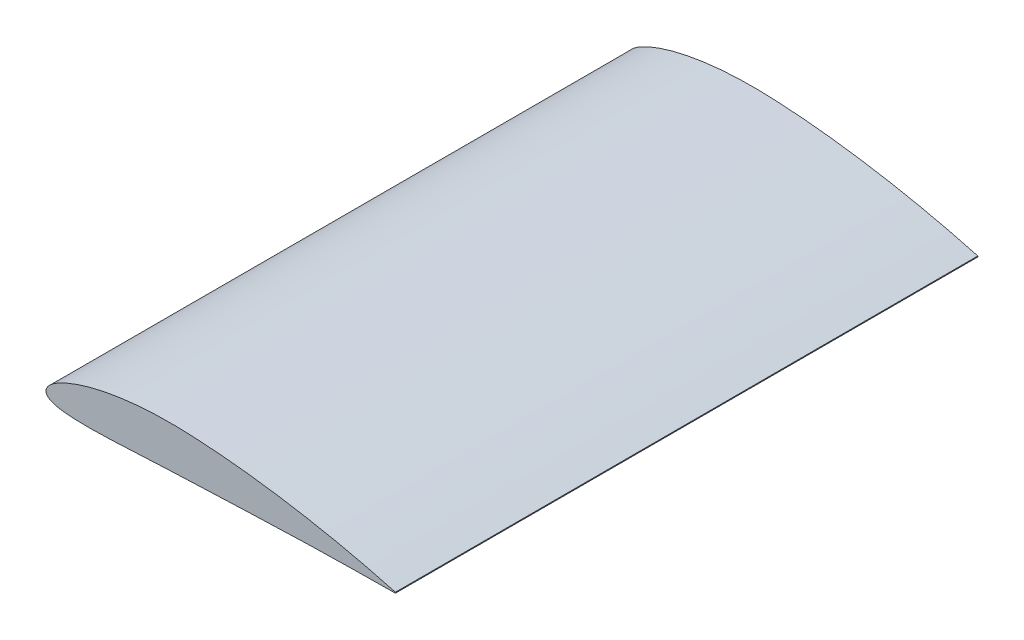
ISO-10303-21;
HEADER;
FILE_DESCRIPTION(('STEP AP214'),'2;1');
FILE_NAME('part.step','',(''),(''),'','','');
FILE_SCHEMA(('AUTOMOTIVE_DESIGN { 1 0 10303 214 1 1 1 1 }'));
ENDSEC;
DATA;
#1=APPLICATION_CONTEXT('core data for automotive mechanical design processes');
#2=APPLICATION_PROTOCOL_DEFINITION('international standard','automotive_design',2000,#1);
#3=PRODUCT_CONTEXT('',#1,'mechanical');
#4=PRODUCT('Part','Part','',(#3));
#5=PRODUCT_RELATED_PRODUCT_CATEGORY('part','',(#4));
#6=PRODUCT_DEFINITION_FORMATION('','',#4);
#7=PRODUCT_DEFINITION_CONTEXT('part definition',#1,'design');
#8=PRODUCT_DEFINITION('design','',#6,#7);
#9=PRODUCT_DEFINITION_SHAPE('','',#8);
#10=(LENGTH_UNIT() NAMED_UNIT(*) SI_UNIT(.MILLI.,.METRE.));
#11=(NAMED_UNIT(*) PLANE_ANGLE_UNIT() SI_UNIT($,.RADIAN.));
#12=(NAMED_UNIT(*) SI_UNIT($,.STERADIAN.) SOLID_ANGLE_UNIT());
#13=UNCERTAINTY_MEASURE_WITH_UNIT(LENGTH_MEASURE(1.E-05),#10,'distance_accuracy_value','');
#14=(GEOMETRIC_REPRESENTATION_CONTEXT(3) GLOBAL_UNCERTAINTY_ASSIGNED_CONTEXT((#13)) GLOBAL_UNIT_ASSIGNED_CONTEXT((#10,
#11,#12)) REPRESENTATION_CONTEXT('',''));
#15=CARTESIAN_POINT('',(0.,0.,0.));
#16=DIRECTION('',(0.,0.,1.));
#17=DIRECTION('',(1.,0.,0.));
#18=AXIS2_PLACEMENT_3D('',#15,#16,#17);
#19=CARTESIAN_POINT('',(0.00249,-0.14724,250.));
#20=CARTESIAN_POINT('',(0.0288641688854633,-0.445513844414603,250.));
#21=CARTESIAN_POINT('',(0.0833057800904263,-1.06121129978275,250.));
#22=CARTESIAN_POINT('',(0.422671390377827,-1.96663822729653,250.));
#23=CARTESIAN_POINT('',(0.976281814573221,-2.83807289649458,250.));
#24=CARTESIAN_POINT('',(1.75645978779488,-3.64713332484532,250.));
#25=CARTESIAN_POINT('',(2.74907794082149,-4.3931984024834,250.));
#26=CARTESIAN_POINT('',(3.96714374613249,-5.08293585867439,250.));
#27=CARTESIAN_POINT('',(5.44229690863356,-5.72840886692502,250.));
#28=CARTESIAN_POINT('',(7.2356982456091,-6.33863063415687,250.));
#29=CARTESIAN_POINT('',(9.44277622720337,-6.91837999855022,250.));
#30=CARTESIAN_POINT('',(12.2025981281143,-7.46605991636749,250.));
#31=CARTESIAN_POINT('',(15.6905256540105,-7.96754247553604,250.));
#32=CARTESIAN_POINT('',(20.0737384988992,-8.3915480858464,250.));
#33=CARTESIAN_POINT('',(25.4279424931762,-8.69681417335037,250.));
#34=CARTESIAN_POINT('',(31.6799813058299,-8.85196661878203,250.));
#35=CARTESIAN_POINT('',(38.6368782746042,-8.85150829562618,250.));
#36=CARTESIAN_POINT('',(46.0773681114888,-8.71372389572811,250.));
#37=CARTESIAN_POINT('',(53.8291461214035,-8.46796962975638,250.));
#38=CARTESIAN_POINT('',(61.7838517154262,-8.14374423824506,250.));
#39=CARTESIAN_POINT('',(69.8771771185494,-7.76678950417677,250.));
#40=CARTESIAN_POINT('',(78.0625135272191,-7.3594227174564,250.));
#41=CARTESIAN_POINT('',(86.2929272510796,-6.94080621211282,250.));
#42=CARTESIAN_POINT('',(94.52565069144,-6.52761654439103,250.));
#43=CARTESIAN_POINT('',(102.732598331766,-6.1331415031146,250.));
#44=CARTESIAN_POINT('',(110.918529107916,-5.76594399090627,250.));
#45=CARTESIAN_POINT('',(119.106037428137,-5.43837798583262,250.));
#46=CARTESIAN_POINT('',(127.316854085887,-5.13392960517217,250.));
#47=CARTESIAN_POINT('',(135.563054016299,-4.80370791115035,250.));
#48=CARTESIAN_POINT('',(143.837285105454,-4.46781142112651,250.));
#49=CARTESIAN_POINT('',(152.128632568186,-4.12808075570405,250.));
#50=CARTESIAN_POINT('',(160.417875855798,-3.79043472053915,250.));
#51=CARTESIAN_POINT('',(168.698244488521,-3.4588568645267,250.));
#52=CARTESIAN_POINT('',(176.966416513952,-3.1367075499438,250.));
#53=CARTESIAN_POINT('',(185.223122892775,-2.82675169781747,250.));
#54=CARTESIAN_POINT('',(193.47005296097,-2.53124390528859,250.));
#55=CARTESIAN_POINT('',(201.709043695345,-2.25196088915263,250.));
#56=CARTESIAN_POINT('',(209.941894226343,-1.99037172481699,250.));
#57=CARTESIAN_POINT('',(218.170315158738,-1.74765374764245,250.));
#58=CARTESIAN_POINT('',(226.395881354852,-1.52446005264915,250.));
#59=CARTESIAN_POINT('',(234.619974201183,-1.32133546096737,250.));
#60=CARTESIAN_POINT('',(242.843439472485,-1.13834062649556,250.));
#61=CARTESIAN_POINT('',(253.799028348439,-0.921290824137908,250.));
#62=CARTESIAN_POINT('',(264.723718399079,-0.743927690678651,250.));
#63=CARTESIAN_POINT('',(275.541156206627,-0.603511415990534,250.));
#64=CARTESIAN_POINT('',(283.304824624749,-0.517817030046947,250.));
#65=CARTESIAN_POINT('',(290.376932295173,-0.451824553738442,250.));
#66=CARTESIAN_POINT('',(295.870764012939,-0.407443063098533,250.));
#67=CARTESIAN_POINT('',(298.944589157433,-0.385525490945527,250.));
#68=CARTESIAN_POINT('',(300.,-0.378,250.));
#69=B_SPLINE_CURVE_WITH_KNOTS('',3,(#19,#20,#21,#22,#23,#24,#25,#26,#27,#28,#29,#30,#31,#32,#33,
#34,#35,#36,#37,#38,#39,#40,#41,#42,#43,#44,#45,#46,#47,#48,#49,#50,#51,#52,#53,#54,#55,#56,#57,
#58,#59,#60,#61,#62,#63,#64,#65,#66,#67,#68),.UNSPECIFIED.,.F.,.F.,(4,1,1,1,1,1,1,1,1,1,1,1,1,1,
1,1,1,1,1,1,1,1,1,1,1,1,1,1,1,1,1,1,1,1,1,1,1,1,1,1,1,1,1,1,1,1,1,4),(0.,0.00295155454187813,
0.00609260468138345,0.00945089974770261,0.0131050353483775,0.0171458323785718,
0.0216960994114763,0.0269215768167943,0.0330527867072691,0.0404178803055317,0.049480061989254,
0.0608721953266465,0.0752631118751332,0.0930303587905709,0.113913710781101,0.137122622864392,
0.161846787507909,0.187529050722836,0.213844767657257,0.240604039549654,0.267679501362261,
0.294919063837578,0.322129351782385,0.34922488677745,0.37620063639372,0.40319053291318,
0.430285050730301,0.457482608831412,0.484832061499181,0.512206010416882,0.53957427714013,
0.566902093806344,0.594185888539568,0.621429901327116,0.648639753003801,0.675821648028279,
0.70298156459292,0.730124951930402,0.757257323678464,0.784383538796943,0.811507209416005,
0.838628701004968,0.892783780904612,0.919594556327485,0.945650049930795,0.969591154880402,
0.989558994627054,1.),.UNSPECIFIED.);
#70=DIRECTION('',(0.,0.,-1.));
#71=VECTOR('',#70,1.);
#72=SURFACE_OF_LINEAR_EXTRUSION('',#69,#71);
#73=CARTESIAN_POINT('',(0.00249,-0.14724,-250.));
#74=CARTESIAN_POINT('',(0.0288641688854633,-0.445513844414603,-250.));
#75=CARTESIAN_POINT('',(0.0833057800904263,-1.06121129978275,-250.));
#76=CARTESIAN_POINT('',(0.422671390377827,-1.96663822729653,-250.));
#77=CARTESIAN_POINT('',(0.976281814573221,-2.83807289649458,-250.));
#78=CARTESIAN_POINT('',(1.75645978779488,-3.64713332484532,-250.));
#79=CARTESIAN_POINT('',(2.74907794082149,-4.3931984024834,-250.));
#80=CARTESIAN_POINT('',(3.96714374613249,-5.08293585867439,-250.));
#81=CARTESIAN_POINT('',(5.44229690863356,-5.72840886692502,-250.));
#82=CARTESIAN_POINT('',(7.2356982456091,-6.33863063415687,-250.));
#83=CARTESIAN_POINT('',(9.44277622720337,-6.91837999855022,-250.));
#84=CARTESIAN_POINT('',(12.2025981281143,-7.46605991636749,-250.));
#85=CARTESIAN_POINT('',(15.6905256540105,-7.96754247553604,-250.));
#86=CARTESIAN_POINT('',(20.0737384988992,-8.3915480858464,-250.));
#87=CARTESIAN_POINT('',(25.4279424931762,-8.69681417335037,-250.));
#88=CARTESIAN_POINT('',(31.6799813058299,-8.85196661878203,-250.));
#89=CARTESIAN_POINT('',(38.6368782746042,-8.85150829562618,-250.));
#90=CARTESIAN_POINT('',(46.0773681114888,-8.71372389572811,-250.));
#91=CARTESIAN_POINT('',(53.8291461214035,-8.46796962975638,-250.));
#92=CARTESIAN_POINT('',(61.7838517154262,-8.14374423824506,-250.));
#93=CARTESIAN_POINT('',(69.8771771185494,-7.76678950417677,-250.));
#94=CARTESIAN_POINT('',(78.0625135272191,-7.3594227174564,-250.));
#95=CARTESIAN_POINT('',(86.2929272510796,-6.94080621211282,-250.));
#96=CARTESIAN_POINT('',(94.52565069144,-6.52761654439103,-250.));
#97=CARTESIAN_POINT('',(102.732598331766,-6.1331415031146,-250.));
#98=CARTESIAN_POINT('',(110.918529107916,-5.76594399090627,-250.));
#99=CARTESIAN_POINT('',(119.106037428137,-5.43837798583262,-250.));
#100=CARTESIAN_POINT('',(127.316854085887,-5.13392960517217,-250.));
#101=CARTESIAN_POINT('',(135.563054016299,-4.80370791115035,-250.));
#102=CARTESIAN_POINT('',(143.837285105454,-4.46781142112651,-250.));
#103=CARTESIAN_POINT('',(152.128632568186,-4.12808075570405,-250.));
#104=CARTESIAN_POINT('',(160.417875855798,-3.79043472053915,-250.));
#105=CARTESIAN_POINT('',(168.698244488521,-3.4588568645267,-250.));
#106=CARTESIAN_POINT('',(176.966416513952,-3.1367075499438,-250.));
#107=CARTESIAN_POINT('',(185.223122892775,-2.82675169781747,-250.));
#108=CARTESIAN_POINT('',(193.47005296097,-2.53124390528859,-250.));
#109=CARTESIAN_POINT('',(201.709043695345,-2.25196088915263,-250.));
#110=CARTESIAN_POINT('',(209.941894226343,-1.99037172481699,-250.));
#111=CARTESIAN_POINT('',(218.170315158738,-1.74765374764245,-250.));
#112=CARTESIAN_POINT('',(226.395881354852,-1.52446005264915,-250.));
#113=CARTESIAN_POINT('',(234.619974201183,-1.32133546096737,-250.));
#114=CARTESIAN_POINT('',(242.843439472485,-1.13834062649556,-250.));
#115=CARTESIAN_POINT('',(253.799028348439,-0.921290824137908,-250.));
#116=CARTESIAN_POINT('',(264.723718399079,-0.743927690678651,-250.));
#117=CARTESIAN_POINT('',(275.541156206627,-0.603511415990534,-250.));
#118=CARTESIAN_POINT('',(283.304824624749,-0.517817030046947,-250.));
#119=CARTESIAN_POINT('',(290.376932295173,-0.451824553738442,-250.));
#120=CARTESIAN_POINT('',(295.870764012939,-0.407443063098533,-250.));
#121=CARTESIAN_POINT('',(298.944589157433,-0.385525490945527,-250.));
#122=CARTESIAN_POINT('',(300.,-0.378,-250.));
#123=B_SPLINE_CURVE_WITH_KNOTS('',3,(#73,#74,#75,#76,#77,#78,#79,#80,#81,#82,#83,#84,#85,#86,
#87,#88,#89,#90,#91,#92,#93,#94,#95,#96,#97,#98,#99,#100,#101,#102,#103,#104,#105,#106,#107,
#108,#109,#110,#111,#112,#113,#114,#115,#116,#117,#118,#119,#120,#121,#122),.UNSPECIFIED.,.F.,
.F.,(4,1,1,1,1,1,1,1,1,1,1,1,1,1,1,1,1,1,1,1,1,1,1,1,1,1,1,1,1,1,1,1,1,1,1,1,1,1,1,1,1,1,1,1,1,
1,1,4),(0.,0.00295155454187813,0.00609260468138345,0.00945089974770261,0.0131050353483775,
0.0171458323785718,0.0216960994114763,0.0269215768167943,0.0330527867072691,0.0404178803055317,
0.049480061989254,0.0608721953266465,0.0752631118751332,0.0930303587905709,0.113913710781101,
0.137122622864392,0.161846787507909,0.187529050722836,0.213844767657257,0.240604039549654,
0.267679501362261,0.294919063837578,0.322129351782385,0.34922488677745,0.37620063639372,
0.40319053291318,0.430285050730301,0.457482608831412,0.484832061499181,0.512206010416882,
0.53957427714013,0.566902093806344,0.594185888539568,0.621429901327116,0.648639753003801,
0.675821648028279,0.70298156459292,0.730124951930402,0.757257323678464,0.784383538796943,
0.811507209416005,0.838628701004968,0.892783780904612,0.919594556327485,0.945650049930795,
0.969591154880402,0.989558994627054,1.),.UNSPECIFIED.);
#124=CARTESIAN_POINT('',(0.00249,-0.14724,-250.));
#125=VERTEX_POINT('',#124);
#126=CARTESIAN_POINT('',(300.,-0.378,-250.));
#127=VERTEX_POINT('',#126);
#128=EDGE_CURVE('E112',#125,#127,#123,.T.);
#129=ORIENTED_EDGE('',*,*,#128,.T.);
#130=DIRECTION('',(0.,0.,-1.));
#131=VECTOR('',#130,1.);
#132=CARTESIAN_POINT('',(300.,-0.378,250.));
#133=LINE('',#132,#131);
#134=CARTESIAN_POINT('',(300.,-0.378,250.));
#135=VERTEX_POINT('',#134);
#136=EDGE_CURVE('E11',#135,#127,#133,.T.);
#137=ORIENTED_EDGE('',*,*,#136,.F.);
#138=CARTESIAN_POINT('',(0.00249,-0.14724,250.));
#139=VERTEX_POINT('',#138);
#140=EDGE_CURVE('E130',#139,#135,#69,.T.);
#141=ORIENTED_EDGE('',*,*,#140,.F.);
#142=DIRECTION('',(0.,0.,-1.));
#143=VECTOR('',#142,1.);
#144=CARTESIAN_POINT('',(0.00249,-0.14724,250.));
#145=LINE('',#144,#143);
#146=EDGE_CURVE('E105',#139,#125,#145,.T.);
#147=ORIENTED_EDGE('',*,*,#146,.T.);
#148=EDGE_LOOP('',(#129,#137,#141,#147));
#149=FACE_BOUND('',#148,.T.);
#150=ADVANCED_FACE('F34',(#149),#72,.F.);
#151=CARTESIAN_POINT('',(299.622,0.,250.));
#152=DIRECTION('',(0.,0.,-1.));
#153=DIRECTION('',(-1.,0.,0.));
#154=AXIS2_PLACEMENT_3D('',#151,#152,#153);
#155=CYLINDRICAL_SURFACE('',#154,0.534572726576983);
#156=CARTESIAN_POINT('',(299.622,0.,-250.));
#157=DIRECTION('',(0.,0.,1.));
#158=DIRECTION('',(-1.,0.,0.));
#159=AXIS2_PLACEMENT_3D('',#156,#157,#158);
#160=CIRCLE('',#159,0.534572726576983);
#161=CARTESIAN_POINT('',(300.,0.378,-250.));
#162=VERTEX_POINT('',#161);
#163=EDGE_CURVE('E117',#127,#162,#160,.T.);
#164=ORIENTED_EDGE('',*,*,#163,.T.);
#165=DIRECTION('',(0.,0.,-1.));
#166=VECTOR('',#165,1.);
#167=CARTESIAN_POINT('',(300.,0.378,250.));
#168=LINE('',#167,#166);
#169=CARTESIAN_POINT('',(300.,0.378,250.));
#170=VERTEX_POINT('',#169);
#171=EDGE_CURVE('E43',#170,#162,#168,.T.);
#172=ORIENTED_EDGE('',*,*,#171,.F.);
#173=CARTESIAN_POINT('',(299.622,0.,250.));
#174=DIRECTION('',(0.,0.,1.));
#175=DIRECTION('',(-1.,0.,0.));
#176=AXIS2_PLACEMENT_3D('',#173,#174,#175);
#177=CIRCLE('',#176,0.534572726576983);
#178=EDGE_CURVE('E85',#135,#170,#177,.T.);
#179=ORIENTED_EDGE('',*,*,#178,.F.);
#180=ORIENTED_EDGE('',*,*,#136,.T.);
#181=EDGE_LOOP('',(#164,#172,#179,#180));
#182=FACE_BOUND('',#181,.T.);
#183=ADVANCED_FACE('F149',(#182),#155,.T.);
#184=CARTESIAN_POINT('',(300.,0.378,250.));
#185=CARTESIAN_POINT('',(298.98680128776,0.654023781403535,250.));
#186=CARTESIAN_POINT('',(296.064210837156,1.45021949101575,250.));
#187=CARTESIAN_POINT('',(290.869598499995,2.83000686313952,250.));
#188=CARTESIAN_POINT('',(284.21971344516,4.54515043735707,250.));
#189=CARTESIAN_POINT('',(276.935901935239,6.35761060470515,250.));
#190=CARTESIAN_POINT('',(269.347101536954,8.17543923315356,250.));
#191=CARTESIAN_POINT('',(261.636652194795,9.9499327589503,250.));
#192=CARTESIAN_POINT('',(253.874886053528,11.663682067936,250.));
#193=CARTESIAN_POINT('',(246.086893810767,13.310849918933,250.));
#194=CARTESIAN_POINT('',(238.28156509519,14.8894208716766,250.));
#195=CARTESIAN_POINT('',(230.462843896224,16.3983575086196,250.));
#196=CARTESIAN_POINT('',(222.633143967381,17.8369119637227,250.));
#197=CARTESIAN_POINT('',(214.794406789338,19.2040857344674,250.));
#198=CARTESIAN_POINT('',(206.948477689533,20.498865738249,250.));
#199=CARTESIAN_POINT('',(199.097180513816,21.7197934093402,250.));
#200=CARTESIAN_POINT('',(191.242416874809,22.8654021777622,250.));
#201=CARTESIAN_POINT('',(183.386166153563,23.9338627233875,250.));
#202=CARTESIAN_POINT('',(175.530527281634,24.923138619396,250.));
#203=CARTESIAN_POINT('',(167.677631749552,25.8308113359842,250.));
#204=CARTESIAN_POINT('',(159.83020407637,26.6544050986667,250.));
#205=CARTESIAN_POINT('',(151.990419631337,27.3908657144166,250.));
#206=CARTESIAN_POINT('',(144.164125101971,28.0367679193056,250.));
#207=CARTESIAN_POINT('',(136.354280568601,28.5896127888858,250.));
#208=CARTESIAN_POINT('',(128.583278444944,29.0402911124387,250.));
#209=CARTESIAN_POINT('',(120.889314831539,29.3980794120577,250.));
#210=CARTESIAN_POINT('',(113.294103257856,29.623979722126,250.));
#211=CARTESIAN_POINT('',(105.787101591505,29.6881147803117,250.));
#212=CARTESIAN_POINT('',(98.338851666315,29.5906189722756,250.));
#213=CARTESIAN_POINT('',(90.9366247098875,29.3292165699766,250.));
#214=CARTESIAN_POINT('',(83.5844315304011,28.8982617847225,250.));
#215=CARTESIAN_POINT('',(76.290492602127,28.2936076331489,250.));
#216=CARTESIAN_POINT('',(69.0662274611627,27.5099359897076,250.));
#217=CARTESIAN_POINT('',(61.9269152260386,26.5428786259249,250.));
#218=CARTESIAN_POINT('',(54.8932803737344,25.387877318499,250.));
#219=CARTESIAN_POINT('',(47.9950291130081,24.0424456674072,250.));
#220=CARTESIAN_POINT('',(41.2775038108488,22.5075794810016,250.));
#221=CARTESIAN_POINT('',(34.8124585242293,20.7931387290732,250.));
#222=CARTESIAN_POINT('',(28.7109580899014,18.9262379057851,250.));
#223=CARTESIAN_POINT('',(23.1248146078509,16.961123320747,250.));
#224=CARTESIAN_POINT('',(18.2149180695505,14.9800025250558,250.));
#225=CARTESIAN_POINT('',(14.0885709481161,13.0747331937673,250.));
#226=CARTESIAN_POINT('',(10.7512462427716,11.315492838388,250.));
#227=CARTESIAN_POINT('',(8.11306941612396,9.73032383929158,250.));
#228=CARTESIAN_POINT('',(6.04045169768157,8.3095656657077,250.));
#229=CARTESIAN_POINT('',(4.40603392011968,7.02507559718571,250.));
#230=CARTESIAN_POINT('',(3.11052134783298,5.84556644236323,250.));
#231=CARTESIAN_POINT('',(2.08581080220328,4.74311489195384,250.));
#232=CARTESIAN_POINT('',(1.28384499577925,3.69713564801613,250.));
#233=CARTESIAN_POINT('',(0.685974492458288,2.68994652273,250.));
#234=CARTESIAN_POINT('',(0.258928678594649,1.71694247641125,250.));
#235=CARTESIAN_POINT('',(0.122706697861263,1.0598900334139,250.));
#236=CARTESIAN_POINT('',(0.05757,0.74571,250.));
#237=B_SPLINE_CURVE_WITH_KNOTS('',3,(#184,#185,#186,#187,#188,#189,#190,#191,#192,#193,#194,
#195,#196,#197,#198,#199,#200,#201,#202,#203,#204,#205,#206,#207,#208,#209,#210,#211,#212,#213,
#214,#215,#216,#217,#218,#219,#220,#221,#222,#223,#224,#225,#226,#227,#228,#229,#230,#231,#232,
#233,#234,#235,#236),.UNSPECIFIED.,.F.,.F.,(4,1,1,1,1,1,1,1,1,1,1,1,1,1,1,1,1,1,1,1,1,1,1,1,1,1,
1,1,1,1,1,1,1,1,1,1,1,1,1,1,1,1,1,1,1,1,1,1,1,1,4),(0.,0.0101621996718152,0.029313053164405,
0.0520116049167947,0.0766194676467142,0.101948061207292,0.127526131749972,0.153184130655642,
0.178867887696566,0.204557902716051,0.230245711588722,0.255925967287604,0.281594302232909,
0.307246419826604,0.332878041533464,0.358484538095463,0.384061185999046,0.409602822472883,
0.435103874040523,0.460559416336008,0.485959195382529,0.511303069995141,0.53655151535457,
0.561723365940153,0.586628866723787,0.611085431247163,0.63525120042125,0.659272175841394,
0.683163753229342,0.706922144180534,0.730535909866309,0.753983199646257,0.777234690063445,
0.800246382303428,0.822950708941546,0.845237155368769,0.866915895838024,0.887662334604257,
0.906968280539555,0.924203157053238,0.938878974509372,0.95093161065299,0.960693484285195,
0.968646729467272,0.975232933115936,0.980794743901537,0.985583761312909,0.989781538836832,
0.99352131251264,0.996902112954681,1.),.UNSPECIFIED.);
#238=DIRECTION('',(0.,0.,-1.));
#239=VECTOR('',#238,1.);
#240=SURFACE_OF_LINEAR_EXTRUSION('',#237,#239);
#241=CARTESIAN_POINT('',(300.,0.378,-250.));
#242=CARTESIAN_POINT('',(298.98680128776,0.654023781403535,-250.));
#243=CARTESIAN_POINT('',(296.064210837156,1.45021949101575,-250.));
#244=CARTESIAN_POINT('',(290.869598499995,2.83000686313952,-250.));
#245=CARTESIAN_POINT('',(284.21971344516,4.54515043735707,-250.));
#246=CARTESIAN_POINT('',(276.935901935239,6.35761060470515,-250.));
#247=CARTESIAN_POINT('',(269.347101536954,8.17543923315356,-250.));
#248=CARTESIAN_POINT('',(261.636652194795,9.9499327589503,-250.));
#249=CARTESIAN_POINT('',(253.874886053528,11.663682067936,-250.));
#250=CARTESIAN_POINT('',(246.086893810767,13.310849918933,-250.));
#251=CARTESIAN_POINT('',(238.28156509519,14.8894208716766,-250.));
#252=CARTESIAN_POINT('',(230.462843896224,16.3983575086196,-250.));
#253=CARTESIAN_POINT('',(222.633143967381,17.8369119637227,-250.));
#254=CARTESIAN_POINT('',(214.794406789338,19.2040857344674,-250.));
#255=CARTESIAN_POINT('',(206.948477689533,20.498865738249,-250.));
#256=CARTESIAN_POINT('',(199.097180513816,21.7197934093402,-250.));
#257=CARTESIAN_POINT('',(191.242416874809,22.8654021777622,-250.));
#258=CARTESIAN_POINT('',(183.386166153563,23.9338627233875,-250.));
#259=CARTESIAN_POINT('',(175.530527281634,24.923138619396,-250.));
#260=CARTESIAN_POINT('',(167.677631749552,25.8308113359842,-250.));
#261=CARTESIAN_POINT('',(159.83020407637,26.6544050986667,-250.));
#262=CARTESIAN_POINT('',(151.990419631337,27.3908657144166,-250.));
#263=CARTESIAN_POINT('',(144.164125101971,28.0367679193056,-250.));
#264=CARTESIAN_POINT('',(136.354280568601,28.5896127888858,-250.));
#265=CARTESIAN_POINT('',(128.583278444944,29.0402911124387,-250.));
#266=CARTESIAN_POINT('',(120.889314831539,29.3980794120577,-250.));
#267=CARTESIAN_POINT('',(113.294103257856,29.623979722126,-250.));
#268=CARTESIAN_POINT('',(105.787101591505,29.6881147803117,-250.));
#269=CARTESIAN_POINT('',(98.338851666315,29.5906189722756,-250.));
#270=CARTESIAN_POINT('',(90.9366247098875,29.3292165699766,-250.));
#271=CARTESIAN_POINT('',(83.5844315304011,28.8982617847225,-250.));
#272=CARTESIAN_POINT('',(76.290492602127,28.2936076331489,-250.));
#273=CARTESIAN_POINT('',(69.0662274611627,27.5099359897076,-250.));
#274=CARTESIAN_POINT('',(61.9269152260386,26.5428786259249,-250.));
#275=CARTESIAN_POINT('',(54.8932803737344,25.387877318499,-250.));
#276=CARTESIAN_POINT('',(47.9950291130081,24.0424456674072,-250.));
#277=CARTESIAN_POINT('',(41.2775038108488,22.5075794810016,-250.));
#278=CARTESIAN_POINT('',(34.8124585242293,20.7931387290732,-250.));
#279=CARTESIAN_POINT('',(28.7109580899014,18.9262379057851,-250.));
#280=CARTESIAN_POINT('',(23.1248146078509,16.961123320747,-250.));
#281=CARTESIAN_POINT('',(18.2149180695505,14.9800025250558,-250.));
#282=CARTESIAN_POINT('',(14.0885709481161,13.0747331937673,-250.));
#283=CARTESIAN_POINT('',(10.7512462427716,11.315492838388,-250.));
#284=CARTESIAN_POINT('',(8.11306941612396,9.73032383929158,-250.));
#285=CARTESIAN_POINT('',(6.04045169768157,8.3095656657077,-250.));
#286=CARTESIAN_POINT('',(4.40603392011968,7.02507559718571,-250.));
#287=CARTESIAN_POINT('',(3.11052134783298,5.84556644236323,-250.));
#288=CARTESIAN_POINT('',(2.08581080220328,4.74311489195384,-250.));
#289=CARTESIAN_POINT('',(1.28384499577925,3.69713564801613,-250.));
#290=CARTESIAN_POINT('',(0.685974492458288,2.68994652273,-250.));
#291=CARTESIAN_POINT('',(0.258928678594649,1.71694247641125,-250.));
#292=CARTESIAN_POINT('',(0.122706697861263,1.0598900334139,-250.));
#293=CARTESIAN_POINT('',(0.05757,0.74571,-250.));
#294=B_SPLINE_CURVE_WITH_KNOTS('',3,(#241,#242,#243,#244,#245,#246,#247,#248,#249,#250,#251,
#252,#253,#254,#255,#256,#257,#258,#259,#260,#261,#262,#263,#264,#265,#266,#267,#268,#269,#270,
#271,#272,#273,#274,#275,#276,#277,#278,#279,#280,#281,#282,#283,#284,#285,#286,#287,#288,#289,
#290,#291,#292,#293),.UNSPECIFIED.,.F.,.F.,(4,1,1,1,1,1,1,1,1,1,1,1,1,1,1,1,1,1,1,1,1,1,1,1,1,1,
1,1,1,1,1,1,1,1,1,1,1,1,1,1,1,1,1,1,1,1,1,1,1,1,4),(0.,0.0101621996718152,0.029313053164405,
0.0520116049167947,0.0766194676467142,0.101948061207292,0.127526131749972,0.153184130655642,
0.178867887696566,0.204557902716051,0.230245711588722,0.255925967287604,0.281594302232909,
0.307246419826604,0.332878041533464,0.358484538095463,0.384061185999046,0.409602822472883,
0.435103874040523,0.460559416336008,0.485959195382529,0.511303069995141,0.53655151535457,
0.561723365940153,0.586628866723787,0.611085431247163,0.63525120042125,0.659272175841394,
0.683163753229342,0.706922144180534,0.730535909866309,0.753983199646257,0.777234690063445,
0.800246382303428,0.822950708941546,0.845237155368769,0.866915895838024,0.887662334604257,
0.906968280539555,0.924203157053238,0.938878974509372,0.95093161065299,0.960693484285195,
0.968646729467272,0.975232933115936,0.980794743901537,0.985583761312909,0.989781538836832,
0.99352131251264,0.996902112954681,1.),.UNSPECIFIED.);
#295=CARTESIAN_POINT('',(0.05757,0.74571,-250.));
#296=VERTEX_POINT('',#295);
#297=EDGE_CURVE('E100',#162,#296,#294,.T.);
#298=ORIENTED_EDGE('',*,*,#297,.T.);
#299=DIRECTION('',(0.,0.,-1.));
#300=VECTOR('',#299,1.);
#301=CARTESIAN_POINT('',(0.05757,0.74571,250.));
#302=LINE('',#301,#300);
#303=CARTESIAN_POINT('',(0.05757,0.74571,250.));
#304=VERTEX_POINT('',#303);
#305=EDGE_CURVE('E97',#304,#296,#302,.T.);
#306=ORIENTED_EDGE('',*,*,#305,.F.);
#307=EDGE_CURVE('E89',#170,#304,#237,.T.);
#308=ORIENTED_EDGE('',*,*,#307,.F.);
#309=ORIENTED_EDGE('',*,*,#171,.T.);
#310=EDGE_LOOP('',(#298,#306,#308,#309));
#311=FACE_BOUND('',#310,.T.);
#312=ADVANCED_FACE('F98',(#311),#240,.F.);
#313=CARTESIAN_POINT('',(0.05757,0.74571,250.));
#314=DIRECTION('',(0.997033212176123,-0.0769725523661737,0.));
#315=DIRECTION('',(0.0769725523661737,0.997033212176123,0.));
#316=AXIS2_PLACEMENT_3D('',#313,#314,#315);
#317=PLANE('',#316);
#318=DIRECTION('',(-0.0769725523661737,-0.997033212176123,0.));
#319=VECTOR('',#318,1.);
#320=CARTESIAN_POINT('',(0.05757,0.74571,-250.));
#321=LINE('',#320,#319);
#322=CARTESIAN_POINT('',(0.,0.,-250.));
#323=VERTEX_POINT('',#322);
#324=EDGE_CURVE('E71',#296,#323,#321,.T.);
#325=ORIENTED_EDGE('',*,*,#324,.T.);
#326=DIRECTION('',(0.,0.,-1.));
#327=VECTOR('',#326,1.);
#328=CARTESIAN_POINT('',(0.,0.,250.));
#329=LINE('',#328,#327);
#330=CARTESIAN_POINT('',(0.,0.,250.));
#331=VERTEX_POINT('',#330);
#332=EDGE_CURVE('E101',#331,#323,#329,.T.);
#333=ORIENTED_EDGE('',*,*,#332,.F.);
#334=DIRECTION('',(-0.0769725523661737,-0.997033212176123,0.));
#335=VECTOR('',#334,1.);
#336=CARTESIAN_POINT('',(0.05757,0.74571,250.));
#337=LINE('',#336,#335);
#338=EDGE_CURVE('E93',#304,#331,#337,.T.);
#339=ORIENTED_EDGE('',*,*,#338,.F.);
#340=ORIENTED_EDGE('',*,*,#305,.T.);
#341=EDGE_LOOP('',(#325,#333,#339,#340));
#342=FACE_BOUND('',#341,.T.);
#343=ADVANCED_FACE('F103',(#342),#317,.F.);
#344=CARTESIAN_POINT('',(0.,0.,250.));
#345=DIRECTION('',(0.999857036905175,0.0169087477716238,0.));
#346=DIRECTION('',(-0.0169087477716238,0.999857036905175,0.));
#347=AXIS2_PLACEMENT_3D('',#344,#345,#346);
#348=PLANE('',#347);
#349=DIRECTION('',(0.0169087477716238,-0.999857036905175,0.));
#350=VECTOR('',#349,1.);
#351=CARTESIAN_POINT('',(0.,0.,-250.));
#352=LINE('',#351,#350);
#353=EDGE_CURVE('E77',#323,#125,#352,.T.);
#354=ORIENTED_EDGE('',*,*,#353,.T.);
#355=ORIENTED_EDGE('',*,*,#146,.F.);
#356=DIRECTION('',(0.0169087477716238,-0.999857036905175,0.));
#357=VECTOR('',#356,1.);
#358=CARTESIAN_POINT('',(0.,0.,250.));
#359=LINE('',#358,#357);
#360=EDGE_CURVE('E51',#331,#139,#359,.T.);
#361=ORIENTED_EDGE('',*,*,#360,.F.);
#362=ORIENTED_EDGE('',*,*,#332,.T.);
#363=EDGE_LOOP('',(#354,#355,#361,#362));
#364=FACE_BOUND('',#363,.T.);
#365=ADVANCED_FACE('F138',(#364),#348,.F.);
#366=CARTESIAN_POINT('',(148.430746079089,-4.2796086798326,250.));
#367=DIRECTION('',(0.,0.,-1.));
#368=DIRECTION('',(-1.,0.,0.));
#369=AXIS2_PLACEMENT_3D('',#366,#367,#368);
#370=PLANE('',#369);
#371=ORIENTED_EDGE('',*,*,#140,.T.);
#372=ORIENTED_EDGE('',*,*,#178,.T.);
#373=ORIENTED_EDGE('',*,*,#307,.T.);
#374=ORIENTED_EDGE('',*,*,#338,.T.);
#375=ORIENTED_EDGE('',*,*,#360,.T.);
#376=EDGE_LOOP('',(#371,#372,#373,#374,#375));
#377=FACE_BOUND('',#376,.T.);
#378=ADVANCED_FACE('F91',(#377),#370,.F.);
#379=CARTESIAN_POINT('',(148.430746079089,-4.2796086798326,-250.));
#380=DIRECTION('',(0.,0.,-1.));
#381=DIRECTION('',(-1.,0.,0.));
#382=AXIS2_PLACEMENT_3D('',#379,#380,#381);
#383=PLANE('',#382);
#384=ORIENTED_EDGE('',*,*,#128,.F.);
#385=ORIENTED_EDGE('',*,*,#353,.F.);
#386=ORIENTED_EDGE('',*,*,#324,.F.);
#387=ORIENTED_EDGE('',*,*,#297,.F.);
#388=ORIENTED_EDGE('',*,*,#163,.F.);
#389=EDGE_LOOP('',(#384,#385,#386,#387,#388));
#390=FACE_BOUND('',#389,.T.);
#391=ADVANCED_FACE('F134',(#390),#383,.T.);
#392=CLOSED_SHELL('',(#150,#183,#312,#343,#365,#378,#391));
#393=MANIFOLD_SOLID_BREP('B2',#392);
#394=ADVANCED_BREP_SHAPE_REPRESENTATION('',(#18,#393),#14);
#395=SHAPE_DEFINITION_REPRESENTATION(#9,#394);
ENDSEC;
END-ISO-10303-21;
